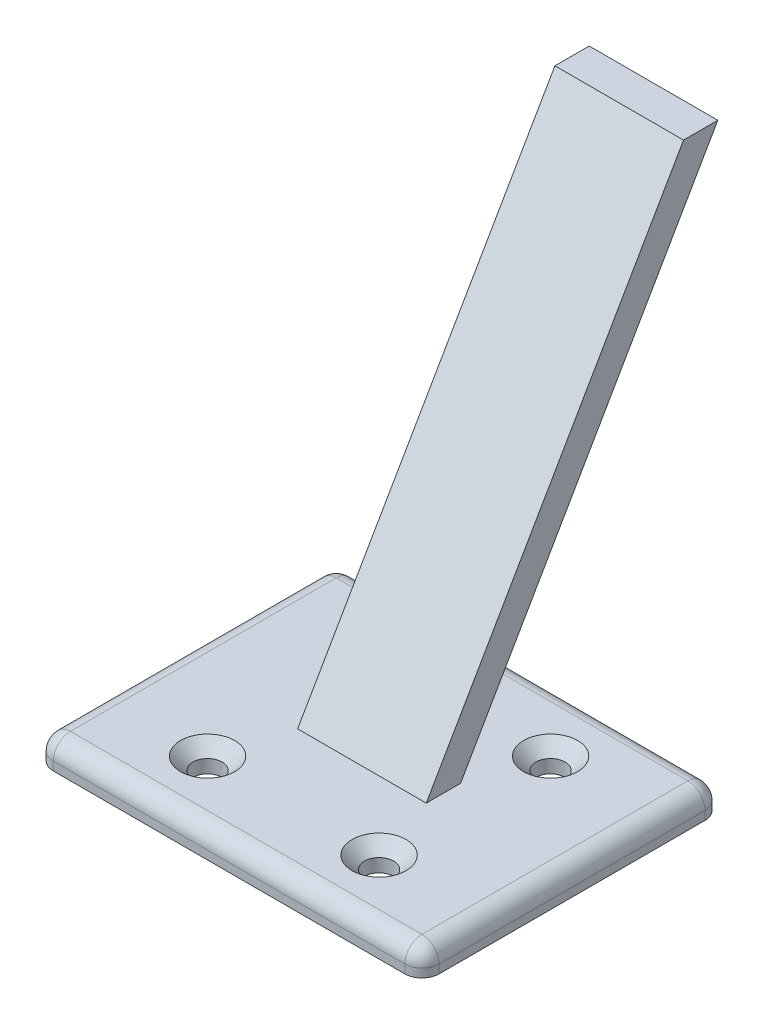
ISO-10303-21;
HEADER;
FILE_DESCRIPTION(('STEP AP214'),'2;1');
FILE_NAME('part.step','',(''),(''),'','','');
FILE_SCHEMA(('AUTOMOTIVE_DESIGN { 1 0 10303 214 1 1 1 1 }'));
ENDSEC;
DATA;
#1=APPLICATION_CONTEXT('core data for automotive mechanical design processes');
#2=APPLICATION_PROTOCOL_DEFINITION('international standard','automotive_design',2000,#1);
#3=PRODUCT_CONTEXT('',#1,'mechanical');
#4=PRODUCT('Part','Part','',(#3));
#5=PRODUCT_RELATED_PRODUCT_CATEGORY('part','',(#4));
#6=PRODUCT_DEFINITION_FORMATION('','',#4);
#7=PRODUCT_DEFINITION_CONTEXT('part definition',#1,'design');
#8=PRODUCT_DEFINITION('design','',#6,#7);
#9=PRODUCT_DEFINITION_SHAPE('','',#8);
#10=(LENGTH_UNIT() NAMED_UNIT(*) SI_UNIT(.MILLI.,.METRE.));
#11=(NAMED_UNIT(*) PLANE_ANGLE_UNIT() SI_UNIT($,.RADIAN.));
#12=(NAMED_UNIT(*) SI_UNIT($,.STERADIAN.) SOLID_ANGLE_UNIT());
#13=UNCERTAINTY_MEASURE_WITH_UNIT(LENGTH_MEASURE(1.E-05),#10,'distance_accuracy_value','');
#14=(GEOMETRIC_REPRESENTATION_CONTEXT(3) GLOBAL_UNCERTAINTY_ASSIGNED_CONTEXT((#13)) GLOBAL_UNIT_ASSIGNED_CONTEXT((#10,
#11,#12)) REPRESENTATION_CONTEXT('',''));
#15=CARTESIAN_POINT('',(0.,0.,0.));
#16=DIRECTION('',(0.,0.,1.));
#17=DIRECTION('',(1.,0.,0.));
#18=AXIS2_PLACEMENT_3D('',#15,#16,#17);
#19=CARTESIAN_POINT('',(0.,3.,0.));
#20=DIRECTION('',(0.,-1.,0.));
#21=DIRECTION('',(0.,0.,-1.));
#22=AXIS2_PLACEMENT_3D('',#19,#20,#21);
#23=PLANE('',#22);
#24=DIRECTION('',(-1.,0.,0.));
#25=VECTOR('',#24,1.);
#26=CARTESIAN_POINT('',(0.,3.,-15.5));
#27=LINE('',#26,#25);
#28=CARTESIAN_POINT('',(20.5,3.,-15.5));
#29=VERTEX_POINT('',#28);
#30=CARTESIAN_POINT('',(-20.5,3.,-15.5));
#31=VERTEX_POINT('',#30);
#32=EDGE_CURVE('E44',#29,#31,#27,.T.);
#33=ORIENTED_EDGE('',*,*,#32,.T.);
#34=DIRECTION('',(0.,0.,1.));
#35=VECTOR('',#34,1.);
#36=CARTESIAN_POINT('',(-20.5,3.,0.));
#37=LINE('',#36,#35);
#38=CARTESIAN_POINT('',(-20.5,3.,15.5));
#39=VERTEX_POINT('',#38);
#40=EDGE_CURVE('E11',#31,#39,#37,.T.);
#41=ORIENTED_EDGE('',*,*,#40,.T.);
#42=DIRECTION('',(1.,0.,0.));
#43=VECTOR('',#42,1.);
#44=CARTESIAN_POINT('',(0.,3.,15.5));
#45=LINE('',#44,#43);
#46=CARTESIAN_POINT('',(20.5,3.,15.5));
#47=VERTEX_POINT('',#46);
#48=EDGE_CURVE('E247',#39,#47,#45,.T.);
#49=ORIENTED_EDGE('',*,*,#48,.T.);
#50=DIRECTION('',(0.,0.,-1.));
#51=VECTOR('',#50,1.);
#52=CARTESIAN_POINT('',(20.5,3.,0.));
#53=LINE('',#52,#51);
#54=EDGE_CURVE('E55',#47,#29,#53,.T.);
#55=ORIENTED_EDGE('',*,*,#54,.T.);
#56=EDGE_LOOP('',(#33,#41,#49,#55));
#57=FACE_BOUND('',#56,.T.);
#58=CARTESIAN_POINT('',(9.99999999999998,3.,-10.));
#59=DIRECTION('',(0.,1.,0.));
#60=DIRECTION('',(0.,0.,1.));
#61=AXIS2_PLACEMENT_3D('',#58,#59,#60);
#62=CIRCLE('',#61,3.15);
#63=CARTESIAN_POINT('',(9.99999999999998,3.,-6.85000000000002));
#64=VERTEX_POINT('',#63);
#65=EDGE_CURVE('E161',#64,#64,#62,.T.);
#66=ORIENTED_EDGE('',*,*,#65,.F.);
#67=EDGE_LOOP('',(#66));
#68=FACE_BOUND('',#67,.T.);
#69=CARTESIAN_POINT('',(-10.,3.,-10.));
#70=DIRECTION('',(0.,1.,0.));
#71=DIRECTION('',(0.,0.,1.));
#72=AXIS2_PLACEMENT_3D('',#69,#70,#71);
#73=CIRCLE('',#72,3.15);
#74=CARTESIAN_POINT('',(-10.,3.,-6.85));
#75=VERTEX_POINT('',#74);
#76=EDGE_CURVE('E175',#75,#75,#73,.T.);
#77=ORIENTED_EDGE('',*,*,#76,.F.);
#78=EDGE_LOOP('',(#77));
#79=FACE_BOUND('',#78,.T.);
#80=CARTESIAN_POINT('',(-9.99999999999999,3.,10.));
#81=DIRECTION('',(0.,1.,0.));
#82=DIRECTION('',(0.,0.,1.));
#83=AXIS2_PLACEMENT_3D('',#80,#81,#82);
#84=CIRCLE('',#83,3.15);
#85=CARTESIAN_POINT('',(-9.99999999999999,3.,13.15));
#86=VERTEX_POINT('',#85);
#87=EDGE_CURVE('E184',#86,#86,#84,.T.);
#88=ORIENTED_EDGE('',*,*,#87,.F.);
#89=EDGE_LOOP('',(#88));
#90=FACE_BOUND('',#89,.T.);
#91=CARTESIAN_POINT('',(10.,3.,10.));
#92=DIRECTION('',(0.,1.,0.));
#93=DIRECTION('',(0.,0.,1.));
#94=AXIS2_PLACEMENT_3D('',#91,#92,#93);
#95=CIRCLE('',#94,3.15);
#96=CARTESIAN_POINT('',(10.,3.,13.15));
#97=VERTEX_POINT('',#96);
#98=EDGE_CURVE('E193',#97,#97,#95,.T.);
#99=ORIENTED_EDGE('',*,*,#98,.F.);
#100=EDGE_LOOP('',(#99));
#101=FACE_BOUND('',#100,.T.);
#102=DIRECTION('',(0.,0.,-1.));
#103=VECTOR('',#102,1.);
#104=CARTESIAN_POINT('',(7.5,3.,2.));
#105=LINE('',#104,#103);
#106=CARTESIAN_POINT('',(7.5,3.,2.));
#107=VERTEX_POINT('',#106);
#108=CARTESIAN_POINT('',(7.5,3.,-2.));
#109=VERTEX_POINT('',#108);
#110=EDGE_CURVE('E160',#107,#109,#105,.T.);
#111=ORIENTED_EDGE('',*,*,#110,.F.);
#112=DIRECTION('',(1.,0.,0.));
#113=VECTOR('',#112,1.);
#114=CARTESIAN_POINT('',(-7.5,3.,2.));
#115=LINE('',#114,#113);
#116=CARTESIAN_POINT('',(-7.5,3.,1.99999999999999));
#117=VERTEX_POINT('',#116);
#118=EDGE_CURVE('E157',#117,#107,#115,.T.);
#119=ORIENTED_EDGE('',*,*,#118,.F.);
#120=DIRECTION('',(0.,0.,1.));
#121=VECTOR('',#120,1.);
#122=CARTESIAN_POINT('',(-7.5,3.,2.));
#123=LINE('',#122,#121);
#124=CARTESIAN_POINT('',(-7.5,3.,-2.));
#125=VERTEX_POINT('',#124);
#126=EDGE_CURVE('E290',#125,#117,#123,.T.);
#127=ORIENTED_EDGE('',*,*,#126,.F.);
#128=DIRECTION('',(-1.,0.,0.));
#129=VECTOR('',#128,1.);
#130=CARTESIAN_POINT('',(-7.5,3.,-2.));
#131=LINE('',#130,#129);
#132=EDGE_CURVE('E288',#109,#125,#131,.T.);
#133=ORIENTED_EDGE('',*,*,#132,.F.);
#134=EDGE_LOOP('',(#111,#119,#127,#133));
#135=FACE_BOUND('',#134,.T.);
#136=ADVANCED_FACE('F35',(#57,#68,#79,#90,#101,#135),#23,.F.);
#137=CARTESIAN_POINT('',(-22.5,3.,-17.5));
#138=DIRECTION('',(1.,0.,0.));
#139=DIRECTION('',(0.,0.,-1.));
#140=AXIS2_PLACEMENT_3D('',#137,#138,#139);
#141=PLANE('',#140);
#142=DIRECTION('',(0.,0.,1.));
#143=VECTOR('',#142,1.);
#144=CARTESIAN_POINT('',(-22.5,1.,-17.5));
#145=LINE('',#144,#143);
#146=CARTESIAN_POINT('',(-22.5,1.,15.5));
#147=VERTEX_POINT('',#146);
#148=CARTESIAN_POINT('',(-22.5,1.,-15.5));
#149=VERTEX_POINT('',#148);
#150=EDGE_CURVE('E214',#147,#149,#145,.F.);
#151=ORIENTED_EDGE('',*,*,#150,.T.);
#152=DIRECTION('',(0.,-1.,0.));
#153=VECTOR('',#152,1.);
#154=CARTESIAN_POINT('',(-22.5,3.,-15.5));
#155=LINE('',#154,#153);
#156=CARTESIAN_POINT('',(-22.5,0.,-15.5));
#157=VERTEX_POINT('',#156);
#158=EDGE_CURVE('E218',#149,#157,#155,.T.);
#159=ORIENTED_EDGE('',*,*,#158,.T.);
#160=DIRECTION('',(0.,0.,1.));
#161=VECTOR('',#160,1.);
#162=CARTESIAN_POINT('',(-22.5,0.,-17.5));
#163=LINE('',#162,#161);
#164=CARTESIAN_POINT('',(-22.5,0.,15.5));
#165=VERTEX_POINT('',#164);
#166=EDGE_CURVE('E202',#157,#165,#163,.T.);
#167=ORIENTED_EDGE('',*,*,#166,.T.);
#168=DIRECTION('',(0.,-1.,0.));
#169=VECTOR('',#168,1.);
#170=CARTESIAN_POINT('',(-22.5,3.,15.5));
#171=LINE('',#170,#169);
#172=EDGE_CURVE('E216',#165,#147,#171,.F.);
#173=ORIENTED_EDGE('',*,*,#172,.T.);
#174=EDGE_LOOP('',(#151,#159,#167,#173));
#175=FACE_BOUND('',#174,.T.);
#176=ADVANCED_FACE('F308',(#175),#141,.F.);
#177=CARTESIAN_POINT('',(22.5,3.,17.5));
#178=DIRECTION('',(0.,0.,-1.));
#179=DIRECTION('',(-1.,0.,0.));
#180=AXIS2_PLACEMENT_3D('',#177,#178,#179);
#181=PLANE('',#180);
#182=DIRECTION('',(1.,0.,0.));
#183=VECTOR('',#182,1.);
#184=CARTESIAN_POINT('',(22.5,1.,17.5));
#185=LINE('',#184,#183);
#186=CARTESIAN_POINT('',(20.5,1.,17.5));
#187=VERTEX_POINT('',#186);
#188=CARTESIAN_POINT('',(-20.5,1.,17.5));
#189=VERTEX_POINT('',#188);
#190=EDGE_CURVE('E241',#187,#189,#185,.F.);
#191=ORIENTED_EDGE('',*,*,#190,.T.);
#192=DIRECTION('',(0.,-1.,0.));
#193=VECTOR('',#192,1.);
#194=CARTESIAN_POINT('',(-20.5,3.,17.5));
#195=LINE('',#194,#193);
#196=CARTESIAN_POINT('',(-20.5,0.,17.5));
#197=VERTEX_POINT('',#196);
#198=EDGE_CURVE('E245',#189,#197,#195,.T.);
#199=ORIENTED_EDGE('',*,*,#198,.T.);
#200=DIRECTION('',(1.,0.,0.));
#201=VECTOR('',#200,1.);
#202=CARTESIAN_POINT('',(22.5,0.,17.5));
#203=LINE('',#202,#201);
#204=CARTESIAN_POINT('',(20.5,0.,17.5));
#205=VERTEX_POINT('',#204);
#206=EDGE_CURVE('E205',#197,#205,#203,.T.);
#207=ORIENTED_EDGE('',*,*,#206,.T.);
#208=DIRECTION('',(0.,-1.,0.));
#209=VECTOR('',#208,1.);
#210=CARTESIAN_POINT('',(20.5,3.,17.5));
#211=LINE('',#210,#209);
#212=EDGE_CURVE('E243',#205,#187,#211,.F.);
#213=ORIENTED_EDGE('',*,*,#212,.T.);
#214=EDGE_LOOP('',(#191,#199,#207,#213));
#215=FACE_BOUND('',#214,.T.);
#216=ADVANCED_FACE('F313',(#215),#181,.F.);
#217=CARTESIAN_POINT('',(22.5,3.,-17.5));
#218=DIRECTION('',(-1.,0.,0.));
#219=DIRECTION('',(0.,0.,1.));
#220=AXIS2_PLACEMENT_3D('',#217,#218,#219);
#221=PLANE('',#220);
#222=DIRECTION('',(0.,0.,-1.));
#223=VECTOR('',#222,1.);
#224=CARTESIAN_POINT('',(22.5,0.,-17.5));
#225=LINE('',#224,#223);
#226=CARTESIAN_POINT('',(22.5,0.,15.5));
#227=VERTEX_POINT('',#226);
#228=CARTESIAN_POINT('',(22.5,0.,-15.5));
#229=VERTEX_POINT('',#228);
#230=EDGE_CURVE('E208',#227,#229,#225,.T.);
#231=ORIENTED_EDGE('',*,*,#230,.T.);
#232=DIRECTION('',(0.,-1.,0.));
#233=VECTOR('',#232,1.);
#234=CARTESIAN_POINT('',(22.5,3.,-15.5));
#235=LINE('',#234,#233);
#236=CARTESIAN_POINT('',(22.5,1.,-15.5));
#237=VERTEX_POINT('',#236);
#238=EDGE_CURVE('E239',#229,#237,#235,.F.);
#239=ORIENTED_EDGE('',*,*,#238,.T.);
#240=DIRECTION('',(0.,0.,-1.));
#241=VECTOR('',#240,1.);
#242=CARTESIAN_POINT('',(22.5,1.,-17.5));
#243=LINE('',#242,#241);
#244=CARTESIAN_POINT('',(22.5,1.,15.5));
#245=VERTEX_POINT('',#244);
#246=EDGE_CURVE('E235',#237,#245,#243,.F.);
#247=ORIENTED_EDGE('',*,*,#246,.T.);
#248=DIRECTION('',(0.,-1.,0.));
#249=VECTOR('',#248,1.);
#250=CARTESIAN_POINT('',(22.5,3.,15.5));
#251=LINE('',#250,#249);
#252=EDGE_CURVE('E237',#245,#227,#251,.T.);
#253=ORIENTED_EDGE('',*,*,#252,.T.);
#254=EDGE_LOOP('',(#231,#239,#247,#253));
#255=FACE_BOUND('',#254,.T.);
#256=ADVANCED_FACE('F328',(#255),#221,.F.);
#257=CARTESIAN_POINT('',(22.5,3.,-17.5));
#258=DIRECTION('',(0.,0.,1.));
#259=DIRECTION('',(1.,0.,0.));
#260=AXIS2_PLACEMENT_3D('',#257,#258,#259);
#261=PLANE('',#260);
#262=DIRECTION('',(-1.,0.,0.));
#263=VECTOR('',#262,1.);
#264=CARTESIAN_POINT('',(22.5,0.,-17.5));
#265=LINE('',#264,#263);
#266=CARTESIAN_POINT('',(20.5,0.,-17.5));
#267=VERTEX_POINT('',#266);
#268=CARTESIAN_POINT('',(-20.5,0.,-17.5));
#269=VERTEX_POINT('',#268);
#270=EDGE_CURVE('E211',#267,#269,#265,.T.);
#271=ORIENTED_EDGE('',*,*,#270,.T.);
#272=DIRECTION('',(0.,-1.,0.));
#273=VECTOR('',#272,1.);
#274=CARTESIAN_POINT('',(-20.5,3.,-17.5));
#275=LINE('',#274,#273);
#276=CARTESIAN_POINT('',(-20.5,1.,-17.5));
#277=VERTEX_POINT('',#276);
#278=EDGE_CURVE('E233',#269,#277,#275,.F.);
#279=ORIENTED_EDGE('',*,*,#278,.T.);
#280=DIRECTION('',(-1.,0.,0.));
#281=VECTOR('',#280,1.);
#282=CARTESIAN_POINT('',(22.5,1.,-17.5));
#283=LINE('',#282,#281);
#284=CARTESIAN_POINT('',(20.5,1.,-17.5));
#285=VERTEX_POINT('',#284);
#286=EDGE_CURVE('E229',#277,#285,#283,.F.);
#287=ORIENTED_EDGE('',*,*,#286,.T.);
#288=DIRECTION('',(0.,-1.,0.));
#289=VECTOR('',#288,1.);
#290=CARTESIAN_POINT('',(20.5,3.,-17.5));
#291=LINE('',#290,#289);
#292=EDGE_CURVE('E231',#285,#267,#291,.T.);
#293=ORIENTED_EDGE('',*,*,#292,.T.);
#294=EDGE_LOOP('',(#271,#279,#287,#293));
#295=FACE_BOUND('',#294,.T.);
#296=ADVANCED_FACE('F324',(#295),#261,.F.);
#297=CARTESIAN_POINT('',(0.,0.,0.));
#298=DIRECTION('',(0.,-1.,0.));
#299=DIRECTION('',(0.,0.,-1.));
#300=AXIS2_PLACEMENT_3D('',#297,#298,#299);
#301=PLANE('',#300);
#302=CARTESIAN_POINT('',(9.99999999999998,0.,-10.));
#303=DIRECTION('',(0.,-1.,0.));
#304=DIRECTION('',(0.,0.,-1.));
#305=AXIS2_PLACEMENT_3D('',#302,#303,#304);
#306=CIRCLE('',#305,1.69999999999999);
#307=CARTESIAN_POINT('',(9.99999999999998,0.,-11.7));
#308=VERTEX_POINT('',#307);
#309=EDGE_CURVE('E172',#308,#308,#306,.T.);
#310=ORIENTED_EDGE('',*,*,#309,.F.);
#311=EDGE_LOOP('',(#310));
#312=FACE_BOUND('',#311,.T.);
#313=CARTESIAN_POINT('',(-10.,0.,-10.));
#314=DIRECTION('',(0.,-1.,0.));
#315=DIRECTION('',(0.,0.,-1.));
#316=AXIS2_PLACEMENT_3D('',#313,#314,#315);
#317=CIRCLE('',#316,1.69999999999999);
#318=CARTESIAN_POINT('',(-10.,0.,-11.7));
#319=VERTEX_POINT('',#318);
#320=EDGE_CURVE('E181',#319,#319,#317,.T.);
#321=ORIENTED_EDGE('',*,*,#320,.F.);
#322=EDGE_LOOP('',(#321));
#323=FACE_BOUND('',#322,.T.);
#324=CARTESIAN_POINT('',(-9.99999999999999,0.,10.));
#325=DIRECTION('',(0.,-1.,0.));
#326=DIRECTION('',(0.,0.,-1.));
#327=AXIS2_PLACEMENT_3D('',#324,#325,#326);
#328=CIRCLE('',#327,1.69999999999999);
#329=CARTESIAN_POINT('',(-9.99999999999999,0.,8.30000000000001));
#330=VERTEX_POINT('',#329);
#331=EDGE_CURVE('E190',#330,#330,#328,.T.);
#332=ORIENTED_EDGE('',*,*,#331,.F.);
#333=EDGE_LOOP('',(#332));
#334=FACE_BOUND('',#333,.T.);
#335=CARTESIAN_POINT('',(10.,0.,10.));
#336=DIRECTION('',(0.,-1.,0.));
#337=DIRECTION('',(0.,0.,-1.));
#338=AXIS2_PLACEMENT_3D('',#335,#336,#337);
#339=CIRCLE('',#338,1.69999999999999);
#340=CARTESIAN_POINT('',(10.,0.,8.30000000000002));
#341=VERTEX_POINT('',#340);
#342=EDGE_CURVE('E199',#341,#341,#339,.T.);
#343=ORIENTED_EDGE('',*,*,#342,.F.);
#344=EDGE_LOOP('',(#343));
#345=FACE_BOUND('',#344,.T.);
#346=ORIENTED_EDGE('',*,*,#166,.F.);
#347=CARTESIAN_POINT('',(-20.5,0.,-15.5));
#348=DIRECTION('',(0.,-1.,0.));
#349=DIRECTION('',(0.,0.,-1.));
#350=AXIS2_PLACEMENT_3D('',#347,#348,#349);
#351=CIRCLE('',#350,2.);
#352=EDGE_CURVE('E227',#157,#269,#351,.T.);
#353=ORIENTED_EDGE('',*,*,#352,.T.);
#354=ORIENTED_EDGE('',*,*,#270,.F.);
#355=CARTESIAN_POINT('',(20.5,0.,-15.5));
#356=DIRECTION('',(0.,-1.,0.));
#357=DIRECTION('',(0.,0.,-1.));
#358=AXIS2_PLACEMENT_3D('',#355,#356,#357);
#359=CIRCLE('',#358,2.);
#360=EDGE_CURVE('E225',#267,#229,#359,.T.);
#361=ORIENTED_EDGE('',*,*,#360,.T.);
#362=ORIENTED_EDGE('',*,*,#230,.F.);
#363=CARTESIAN_POINT('',(20.5,0.,15.5));
#364=DIRECTION('',(0.,-1.,0.));
#365=DIRECTION('',(0.,0.,-1.));
#366=AXIS2_PLACEMENT_3D('',#363,#364,#365);
#367=CIRCLE('',#366,2.);
#368=EDGE_CURVE('E221',#227,#205,#367,.T.);
#369=ORIENTED_EDGE('',*,*,#368,.T.);
#370=ORIENTED_EDGE('',*,*,#206,.F.);
#371=CARTESIAN_POINT('',(-20.5,0.,15.5));
#372=DIRECTION('',(0.,-1.,0.));
#373=DIRECTION('',(0.,0.,-1.));
#374=AXIS2_PLACEMENT_3D('',#371,#372,#373);
#375=CIRCLE('',#374,2.);
#376=EDGE_CURVE('E223',#197,#165,#375,.T.);
#377=ORIENTED_EDGE('',*,*,#376,.T.);
#378=EDGE_LOOP('',(#346,#353,#354,#361,#362,#369,#370,#377));
#379=FACE_BOUND('',#378,.T.);
#380=ADVANCED_FACE('F321',(#312,#323,#334,#345,#379),#301,.T.);
#381=CARTESIAN_POINT('',(10.,3.,10.));
#382=DIRECTION('',(0.,1.,0.));
#383=DIRECTION('',(0.,0.,1.));
#384=AXIS2_PLACEMENT_3D('',#381,#382,#383);
#385=CYLINDRICAL_SURFACE('',#384,1.69999999999999);
#386=CARTESIAN_POINT('',(10.,1.54999999999999,10.));
#387=DIRECTION('',(0.,1.,0.));
#388=DIRECTION('',(0.,0.,1.));
#389=AXIS2_PLACEMENT_3D('',#386,#387,#388);
#390=CIRCLE('',#389,1.69999999999999);
#391=CARTESIAN_POINT('',(10.,1.54999999999999,11.7));
#392=VERTEX_POINT('',#391);
#393=EDGE_CURVE('E196',#392,#392,#390,.T.);
#394=ORIENTED_EDGE('',*,*,#393,.T.);
#395=EDGE_LOOP('',(#394));
#396=FACE_BOUND('',#395,.T.);
#397=ORIENTED_EDGE('',*,*,#342,.T.);
#398=EDGE_LOOP('',(#397));
#399=FACE_BOUND('',#398,.T.);
#400=ADVANCED_FACE('F319',(#396,#399),#385,.F.);
#401=CARTESIAN_POINT('',(10.,3.,10.));
#402=DIRECTION('',(0.,1.,0.));
#403=DIRECTION('',(0.,0.,1.));
#404=AXIS2_PLACEMENT_3D('',#401,#402,#403);
#405=CONICAL_SURFACE('',#404,3.15,0.78539816339745);
#406=ORIENTED_EDGE('',*,*,#393,.F.);
#407=EDGE_LOOP('',(#406));
#408=FACE_BOUND('',#407,.T.);
#409=ORIENTED_EDGE('',*,*,#98,.T.);
#410=EDGE_LOOP('',(#409));
#411=FACE_BOUND('',#410,.T.);
#412=ADVANCED_FACE('F445',(#408,#411),#405,.F.);
#413=CARTESIAN_POINT('',(-9.99999999999999,3.,10.));
#414=DIRECTION('',(0.,1.,0.));
#415=DIRECTION('',(0.,0.,1.));
#416=AXIS2_PLACEMENT_3D('',#413,#414,#415);
#417=CYLINDRICAL_SURFACE('',#416,1.69999999999999);
#418=CARTESIAN_POINT('',(-9.99999999999999,1.54999999999999,10.));
#419=DIRECTION('',(0.,1.,0.));
#420=DIRECTION('',(0.,0.,1.));
#421=AXIS2_PLACEMENT_3D('',#418,#419,#420);
#422=CIRCLE('',#421,1.69999999999999);
#423=CARTESIAN_POINT('',(-9.99999999999999,1.54999999999999,11.7));
#424=VERTEX_POINT('',#423);
#425=EDGE_CURVE('E187',#424,#424,#422,.T.);
#426=ORIENTED_EDGE('',*,*,#425,.T.);
#427=EDGE_LOOP('',(#426));
#428=FACE_BOUND('',#427,.T.);
#429=ORIENTED_EDGE('',*,*,#331,.T.);
#430=EDGE_LOOP('',(#429));
#431=FACE_BOUND('',#430,.T.);
#432=ADVANCED_FACE('F442',(#428,#431),#417,.F.);
#433=CARTESIAN_POINT('',(-9.99999999999999,3.,10.));
#434=DIRECTION('',(0.,1.,0.));
#435=DIRECTION('',(0.,0.,1.));
#436=AXIS2_PLACEMENT_3D('',#433,#434,#435);
#437=CONICAL_SURFACE('',#436,3.15,0.78539816339745);
#438=ORIENTED_EDGE('',*,*,#425,.F.);
#439=EDGE_LOOP('',(#438));
#440=FACE_BOUND('',#439,.T.);
#441=ORIENTED_EDGE('',*,*,#87,.T.);
#442=EDGE_LOOP('',(#441));
#443=FACE_BOUND('',#442,.T.);
#444=ADVANCED_FACE('F438',(#440,#443),#437,.F.);
#445=CARTESIAN_POINT('',(-10.,3.,-10.));
#446=DIRECTION('',(0.,1.,0.));
#447=DIRECTION('',(0.,0.,1.));
#448=AXIS2_PLACEMENT_3D('',#445,#446,#447);
#449=CYLINDRICAL_SURFACE('',#448,1.69999999999999);
#450=CARTESIAN_POINT('',(-10.,1.54999999999999,-10.));
#451=DIRECTION('',(0.,1.,0.));
#452=DIRECTION('',(0.,0.,1.));
#453=AXIS2_PLACEMENT_3D('',#450,#451,#452);
#454=CIRCLE('',#453,1.69999999999999);
#455=CARTESIAN_POINT('',(-10.,1.54999999999999,-8.30000000000001));
#456=VERTEX_POINT('',#455);
#457=EDGE_CURVE('E178',#456,#456,#454,.T.);
#458=ORIENTED_EDGE('',*,*,#457,.T.);
#459=EDGE_LOOP('',(#458));
#460=FACE_BOUND('',#459,.T.);
#461=ORIENTED_EDGE('',*,*,#320,.T.);
#462=EDGE_LOOP('',(#461));
#463=FACE_BOUND('',#462,.T.);
#464=ADVANCED_FACE('F434',(#460,#463),#449,.F.);
#465=CARTESIAN_POINT('',(-10.,3.,-10.));
#466=DIRECTION('',(0.,1.,0.));
#467=DIRECTION('',(0.,0.,1.));
#468=AXIS2_PLACEMENT_3D('',#465,#466,#467);
#469=CONICAL_SURFACE('',#468,3.15,0.78539816339745);
#470=ORIENTED_EDGE('',*,*,#457,.F.);
#471=EDGE_LOOP('',(#470));
#472=FACE_BOUND('',#471,.T.);
#473=ORIENTED_EDGE('',*,*,#76,.T.);
#474=EDGE_LOOP('',(#473));
#475=FACE_BOUND('',#474,.T.);
#476=ADVANCED_FACE('F430',(#472,#475),#469,.F.);
#477=CARTESIAN_POINT('',(9.99999999999998,3.,-10.));
#478=DIRECTION('',(0.,1.,0.));
#479=DIRECTION('',(0.,0.,1.));
#480=AXIS2_PLACEMENT_3D('',#477,#478,#479);
#481=CYLINDRICAL_SURFACE('',#480,1.69999999999999);
#482=CARTESIAN_POINT('',(9.99999999999998,1.54999999999999,-10.));
#483=DIRECTION('',(0.,1.,0.));
#484=DIRECTION('',(0.,0.,1.));
#485=AXIS2_PLACEMENT_3D('',#482,#483,#484);
#486=CIRCLE('',#485,1.69999999999999);
#487=CARTESIAN_POINT('',(9.99999999999998,1.54999999999999,-8.30000000000003));
#488=VERTEX_POINT('',#487);
#489=EDGE_CURVE('E164',#488,#488,#486,.T.);
#490=ORIENTED_EDGE('',*,*,#489,.T.);
#491=EDGE_LOOP('',(#490));
#492=FACE_BOUND('',#491,.T.);
#493=ORIENTED_EDGE('',*,*,#309,.T.);
#494=EDGE_LOOP('',(#493));
#495=FACE_BOUND('',#494,.T.);
#496=ADVANCED_FACE('F426',(#492,#495),#481,.F.);
#497=CARTESIAN_POINT('',(9.99999999999998,3.,-10.));
#498=DIRECTION('',(0.,1.,0.));
#499=DIRECTION('',(0.,0.,1.));
#500=AXIS2_PLACEMENT_3D('',#497,#498,#499);
#501=CONICAL_SURFACE('',#500,3.15,0.78539816339745);
#502=ORIENTED_EDGE('',*,*,#489,.F.);
#503=EDGE_LOOP('',(#502));
#504=FACE_BOUND('',#503,.T.);
#505=ORIENTED_EDGE('',*,*,#65,.T.);
#506=EDGE_LOOP('',(#505));
#507=FACE_BOUND('',#506,.T.);
#508=ADVANCED_FACE('F423',(#504,#507),#501,.F.);
#509=CARTESIAN_POINT('',(7.5,54.9615242270662,-28.0000000000002));
#510=DIRECTION('',(-1.,0.,0.));
#511=DIRECTION('',(0.,0.,1.));
#512=AXIS2_PLACEMENT_3D('',#509,#510,#511);
#513=PLANE('',#512);
#514=ORIENTED_EDGE('',*,*,#110,.T.);
#515=DIRECTION('',(0.,-0.866025403784436,0.500000000000004));
#516=VECTOR('',#515,1.);
#517=CARTESIAN_POINT('',(7.5,54.9615242270662,-32.0000000000002));
#518=LINE('',#517,#516);
#519=CARTESIAN_POINT('',(7.5,54.9615242270662,-32.0000000000002));
#520=VERTEX_POINT('',#519);
#521=EDGE_CURVE('E141',#520,#109,#518,.T.);
#522=ORIENTED_EDGE('',*,*,#521,.F.);
#523=DIRECTION('',(0.,0.,-1.));
#524=VECTOR('',#523,1.);
#525=CARTESIAN_POINT('',(7.5,54.9615242270662,-28.0000000000002));
#526=LINE('',#525,#524);
#527=CARTESIAN_POINT('',(7.5,54.9615242270662,-28.0000000000002));
#528=VERTEX_POINT('',#527);
#529=EDGE_CURVE('E148',#528,#520,#526,.T.);
#530=ORIENTED_EDGE('',*,*,#529,.F.);
#531=DIRECTION('',(0.,-0.866025403784436,0.500000000000004));
#532=VECTOR('',#531,1.);
#533=CARTESIAN_POINT('',(7.5,54.9615242270662,-28.0000000000002));
#534=LINE('',#533,#532);
#535=EDGE_CURVE('E299',#528,#107,#534,.T.);
#536=ORIENTED_EDGE('',*,*,#535,.T.);
#537=EDGE_LOOP('',(#514,#522,#530,#536));
#538=FACE_BOUND('',#537,.T.);
#539=ADVANCED_FACE('F159',(#538),#513,.F.);
#540=CARTESIAN_POINT('',(-7.5,54.9615242270662,-32.0000000000002));
#541=DIRECTION('',(0.,0.500000000000004,0.866025403784436));
#542=DIRECTION('',(0.,-0.866025403784436,0.500000000000004));
#543=AXIS2_PLACEMENT_3D('',#540,#541,#542);
#544=PLANE('',#543);
#545=ORIENTED_EDGE('',*,*,#132,.T.);
#546=DIRECTION('',(0.,-0.866025403784436,0.500000000000004));
#547=VECTOR('',#546,1.);
#548=CARTESIAN_POINT('',(-7.5,54.9615242270662,-32.0000000000002));
#549=LINE('',#548,#547);
#550=CARTESIAN_POINT('',(-7.5,54.9615242270662,-32.0000000000002));
#551=VERTEX_POINT('',#550);
#552=EDGE_CURVE('E144',#551,#125,#549,.T.);
#553=ORIENTED_EDGE('',*,*,#552,.F.);
#554=DIRECTION('',(-1.,0.,0.));
#555=VECTOR('',#554,1.);
#556=CARTESIAN_POINT('',(-7.5,54.9615242270662,-32.0000000000002));
#557=LINE('',#556,#555);
#558=EDGE_CURVE('E136',#520,#551,#557,.T.);
#559=ORIENTED_EDGE('',*,*,#558,.F.);
#560=ORIENTED_EDGE('',*,*,#521,.T.);
#561=EDGE_LOOP('',(#545,#553,#559,#560));
#562=FACE_BOUND('',#561,.T.);
#563=ADVANCED_FACE('F139',(#562),#544,.F.);
#564=CARTESIAN_POINT('',(-7.5,54.9615242270662,-28.0000000000002));
#565=DIRECTION('',(1.,0.,0.));
#566=DIRECTION('',(0.,0.,-1.));
#567=AXIS2_PLACEMENT_3D('',#564,#565,#566);
#568=PLANE('',#567);
#569=ORIENTED_EDGE('',*,*,#126,.T.);
#570=DIRECTION('',(0.,-0.866025403784436,0.500000000000004));
#571=VECTOR('',#570,1.);
#572=CARTESIAN_POINT('',(-7.5,54.9615242270662,-28.0000000000002));
#573=LINE('',#572,#571);
#574=CARTESIAN_POINT('',(-7.5,54.9615242270662,-28.0000000000002));
#575=VERTEX_POINT('',#574);
#576=EDGE_CURVE('E166',#575,#117,#573,.T.);
#577=ORIENTED_EDGE('',*,*,#576,.F.);
#578=DIRECTION('',(0.,0.,1.));
#579=VECTOR('',#578,1.);
#580=CARTESIAN_POINT('',(-7.5,54.9615242270662,-28.0000000000002));
#581=LINE('',#580,#579);
#582=EDGE_CURVE('E147',#551,#575,#581,.T.);
#583=ORIENTED_EDGE('',*,*,#582,.F.);
#584=ORIENTED_EDGE('',*,*,#552,.T.);
#585=EDGE_LOOP('',(#569,#577,#583,#584));
#586=FACE_BOUND('',#585,.T.);
#587=ADVANCED_FACE('F305',(#586),#568,.F.);
#588=CARTESIAN_POINT('',(-7.5,54.9615242270662,-28.0000000000002));
#589=DIRECTION('',(0.,-0.500000000000004,-0.866025403784436));
#590=DIRECTION('',(0.,0.866025403784436,-0.500000000000004));
#591=AXIS2_PLACEMENT_3D('',#588,#589,#590);
#592=PLANE('',#591);
#593=ORIENTED_EDGE('',*,*,#118,.T.);
#594=ORIENTED_EDGE('',*,*,#535,.F.);
#595=DIRECTION('',(1.,0.,0.));
#596=VECTOR('',#595,1.);
#597=CARTESIAN_POINT('',(-7.5,54.9615242270662,-28.0000000000002));
#598=LINE('',#597,#596);
#599=EDGE_CURVE('E153',#575,#528,#598,.T.);
#600=ORIENTED_EDGE('',*,*,#599,.F.);
#601=ORIENTED_EDGE('',*,*,#576,.T.);
#602=EDGE_LOOP('',(#593,#594,#600,#601));
#603=FACE_BOUND('',#602,.T.);
#604=ADVANCED_FACE('F303',(#603),#592,.F.);
#605=CARTESIAN_POINT('',(0.,54.9615242270662,-30.0000000000002));
#606=DIRECTION('',(0.,-1.,0.));
#607=DIRECTION('',(0.,0.,-1.));
#608=AXIS2_PLACEMENT_3D('',#605,#606,#607);
#609=PLANE('',#608);
#610=ORIENTED_EDGE('',*,*,#529,.T.);
#611=ORIENTED_EDGE('',*,*,#558,.T.);
#612=ORIENTED_EDGE('',*,*,#582,.T.);
#613=ORIENTED_EDGE('',*,*,#599,.T.);
#614=EDGE_LOOP('',(#610,#611,#612,#613));
#615=FACE_BOUND('',#614,.T.);
#616=ADVANCED_FACE('F151',(#615),#609,.F.);
#617=CARTESIAN_POINT('',(20.5,3.,15.5));
#618=DIRECTION('',(0.,-1.,0.));
#619=DIRECTION('',(0.,0.,-1.));
#620=AXIS2_PLACEMENT_3D('',#617,#618,#619);
#621=CYLINDRICAL_SURFACE('',#620,2.);
#622=CARTESIAN_POINT('',(20.5,1.,15.5));
#623=DIRECTION('',(0.,1.,0.));
#624=DIRECTION('',(0.,0.,1.));
#625=AXIS2_PLACEMENT_3D('',#622,#623,#624);
#626=CIRCLE('',#625,2.);
#627=EDGE_CURVE('E39',#187,#245,#626,.T.);
#628=ORIENTED_EDGE('',*,*,#627,.F.);
#629=ORIENTED_EDGE('',*,*,#212,.F.);
#630=ORIENTED_EDGE('',*,*,#368,.F.);
#631=ORIENTED_EDGE('',*,*,#252,.F.);
#632=EDGE_LOOP('',(#628,#629,#630,#631));
#633=FACE_BOUND('',#632,.T.);
#634=ADVANCED_FACE('F37',(#633),#621,.T.);
#635=CARTESIAN_POINT('',(20.5,1.,15.5));
#636=DIRECTION('',(0.,0.,1.));
#637=DIRECTION('',(1.,0.,0.));
#638=AXIS2_PLACEMENT_3D('',#635,#636,#637);
#639=SPHERICAL_SURFACE('',#638,2.);
#640=CARTESIAN_POINT('',(20.5,1.,15.5));
#641=DIRECTION('',(1.,0.,0.));
#642=DIRECTION('',(0.,0.,-1.));
#643=AXIS2_PLACEMENT_3D('',#640,#641,#642);
#644=CIRCLE('',#643,2.);
#645=EDGE_CURVE('E277',#187,#47,#644,.F.);
#646=ORIENTED_EDGE('',*,*,#645,.F.);
#647=ORIENTED_EDGE('',*,*,#627,.T.);
#648=CARTESIAN_POINT('',(20.5,1.,15.5));
#649=DIRECTION('',(0.,0.,1.));
#650=DIRECTION('',(0.,-1.,0.));
#651=AXIS2_PLACEMENT_3D('',#648,#649,#650);
#652=CIRCLE('',#651,2.);
#653=EDGE_CURVE('E279',#47,#245,#652,.F.);
#654=ORIENTED_EDGE('',*,*,#653,.F.);
#655=EDGE_LOOP('',(#646,#647,#654));
#656=FACE_BOUND('',#655,.T.);
#657=ADVANCED_FACE('F373',(#656),#639,.T.);
#658=CARTESIAN_POINT('',(20.5,3.,-15.5));
#659=DIRECTION('',(0.,-1.,0.));
#660=DIRECTION('',(0.,0.,-1.));
#661=AXIS2_PLACEMENT_3D('',#658,#659,#660);
#662=CYLINDRICAL_SURFACE('',#661,2.);
#663=ORIENTED_EDGE('',*,*,#360,.F.);
#664=ORIENTED_EDGE('',*,*,#292,.F.);
#665=CARTESIAN_POINT('',(20.5,1.,-15.5));
#666=DIRECTION('',(0.,1.,0.));
#667=DIRECTION('',(0.,0.,1.));
#668=AXIS2_PLACEMENT_3D('',#665,#666,#667);
#669=CIRCLE('',#668,2.);
#670=EDGE_CURVE('E274',#237,#285,#669,.T.);
#671=ORIENTED_EDGE('',*,*,#670,.F.);
#672=ORIENTED_EDGE('',*,*,#238,.F.);
#673=EDGE_LOOP('',(#663,#664,#671,#672));
#674=FACE_BOUND('',#673,.T.);
#675=ADVANCED_FACE('F371',(#674),#662,.T.);
#676=CARTESIAN_POINT('',(20.5,1.,0.));
#677=DIRECTION('',(0.,0.,-1.));
#678=DIRECTION('',(-1.,0.,0.));
#679=AXIS2_PLACEMENT_3D('',#676,#677,#678);
#680=CYLINDRICAL_SURFACE('',#679,2.);
#681=ORIENTED_EDGE('',*,*,#653,.T.);
#682=ORIENTED_EDGE('',*,*,#246,.F.);
#683=CARTESIAN_POINT('',(20.5,1.,-15.5));
#684=DIRECTION('',(0.,0.,-1.));
#685=DIRECTION('',(-1.,0.,0.));
#686=AXIS2_PLACEMENT_3D('',#683,#684,#685);
#687=CIRCLE('',#686,2.);
#688=EDGE_CURVE('E271',#29,#237,#687,.T.);
#689=ORIENTED_EDGE('',*,*,#688,.F.);
#690=ORIENTED_EDGE('',*,*,#54,.F.);
#691=EDGE_LOOP('',(#681,#682,#689,#690));
#692=FACE_BOUND('',#691,.T.);
#693=ADVANCED_FACE('F367',(#692),#680,.T.);
#694=CARTESIAN_POINT('',(0.,1.,15.5));
#695=DIRECTION('',(1.,0.,0.));
#696=DIRECTION('',(0.,0.,-1.));
#697=AXIS2_PLACEMENT_3D('',#694,#695,#696);
#698=CYLINDRICAL_SURFACE('',#697,2.);
#699=ORIENTED_EDGE('',*,*,#645,.T.);
#700=ORIENTED_EDGE('',*,*,#48,.F.);
#701=CARTESIAN_POINT('',(-20.5,1.,15.5));
#702=DIRECTION('',(-1.,0.,0.));
#703=DIRECTION('',(0.,-1.,0.));
#704=AXIS2_PLACEMENT_3D('',#701,#702,#703);
#705=CIRCLE('',#704,2.);
#706=EDGE_CURVE('E268',#189,#39,#705,.T.);
#707=ORIENTED_EDGE('',*,*,#706,.F.);
#708=ORIENTED_EDGE('',*,*,#190,.F.);
#709=EDGE_LOOP('',(#699,#700,#707,#708));
#710=FACE_BOUND('',#709,.T.);
#711=ADVANCED_FACE('F363',(#710),#698,.T.);
#712=CARTESIAN_POINT('',(-20.5,3.,15.5));
#713=DIRECTION('',(0.,-1.,0.));
#714=DIRECTION('',(0.,0.,-1.));
#715=AXIS2_PLACEMENT_3D('',#712,#713,#714);
#716=CYLINDRICAL_SURFACE('',#715,2.);
#717=ORIENTED_EDGE('',*,*,#376,.F.);
#718=ORIENTED_EDGE('',*,*,#198,.F.);
#719=CARTESIAN_POINT('',(-20.5,1.,15.5));
#720=DIRECTION('',(0.,1.,0.));
#721=DIRECTION('',(0.,0.,1.));
#722=AXIS2_PLACEMENT_3D('',#719,#720,#721);
#723=CIRCLE('',#722,2.);
#724=EDGE_CURVE('E265',#147,#189,#723,.T.);
#725=ORIENTED_EDGE('',*,*,#724,.F.);
#726=ORIENTED_EDGE('',*,*,#172,.F.);
#727=EDGE_LOOP('',(#717,#718,#725,#726));
#728=FACE_BOUND('',#727,.T.);
#729=ADVANCED_FACE('F359',(#728),#716,.T.);
#730=CARTESIAN_POINT('',(20.5,1.,-15.5));
#731=DIRECTION('',(0.,0.,1.));
#732=DIRECTION('',(1.,0.,0.));
#733=AXIS2_PLACEMENT_3D('',#730,#731,#732);
#734=SPHERICAL_SURFACE('',#733,2.);
#735=ORIENTED_EDGE('',*,*,#688,.T.);
#736=ORIENTED_EDGE('',*,*,#670,.T.);
#737=CARTESIAN_POINT('',(20.5,1.,-15.5));
#738=DIRECTION('',(1.,0.,0.));
#739=DIRECTION('',(0.,0.,-1.));
#740=AXIS2_PLACEMENT_3D('',#737,#738,#739);
#741=CIRCLE('',#740,2.);
#742=EDGE_CURVE('E262',#29,#285,#741,.F.);
#743=ORIENTED_EDGE('',*,*,#742,.F.);
#744=EDGE_LOOP('',(#735,#736,#743));
#745=FACE_BOUND('',#744,.T.);
#746=ADVANCED_FACE('F355',(#745),#734,.T.);
#747=CARTESIAN_POINT('',(-20.5,1.,15.5));
#748=DIRECTION('',(0.,0.,1.));
#749=DIRECTION('',(1.,0.,0.));
#750=AXIS2_PLACEMENT_3D('',#747,#748,#749);
#751=SPHERICAL_SURFACE('',#750,2.);
#752=ORIENTED_EDGE('',*,*,#724,.T.);
#753=ORIENTED_EDGE('',*,*,#706,.T.);
#754=CARTESIAN_POINT('',(-20.5,1.,15.5));
#755=DIRECTION('',(0.,0.,1.));
#756=DIRECTION('',(1.,0.,0.));
#757=AXIS2_PLACEMENT_3D('',#754,#755,#756);
#758=CIRCLE('',#757,2.);
#759=EDGE_CURVE('E260',#147,#39,#758,.F.);
#760=ORIENTED_EDGE('',*,*,#759,.F.);
#761=EDGE_LOOP('',(#752,#753,#760));
#762=FACE_BOUND('',#761,.T.);
#763=ADVANCED_FACE('F351',(#762),#751,.T.);
#764=CARTESIAN_POINT('',(0.,1.,-15.5));
#765=DIRECTION('',(-1.,0.,0.));
#766=DIRECTION('',(0.,0.,1.));
#767=AXIS2_PLACEMENT_3D('',#764,#765,#766);
#768=CYLINDRICAL_SURFACE('',#767,2.);
#769=ORIENTED_EDGE('',*,*,#742,.T.);
#770=ORIENTED_EDGE('',*,*,#286,.F.);
#771=CARTESIAN_POINT('',(-20.5,1.,-15.5));
#772=DIRECTION('',(-1.,0.,0.));
#773=DIRECTION('',(0.,0.,1.));
#774=AXIS2_PLACEMENT_3D('',#771,#772,#773);
#775=CIRCLE('',#774,2.);
#776=EDGE_CURVE('E257',#31,#277,#775,.T.);
#777=ORIENTED_EDGE('',*,*,#776,.F.);
#778=ORIENTED_EDGE('',*,*,#32,.F.);
#779=EDGE_LOOP('',(#769,#770,#777,#778));
#780=FACE_BOUND('',#779,.T.);
#781=ADVANCED_FACE('F347',(#780),#768,.T.);
#782=CARTESIAN_POINT('',(-20.5,1.,0.));
#783=DIRECTION('',(0.,0.,1.));
#784=DIRECTION('',(1.,0.,0.));
#785=AXIS2_PLACEMENT_3D('',#782,#783,#784);
#786=CYLINDRICAL_SURFACE('',#785,2.);
#787=ORIENTED_EDGE('',*,*,#759,.T.);
#788=ORIENTED_EDGE('',*,*,#40,.F.);
#789=CARTESIAN_POINT('',(-20.5,1.,-15.5));
#790=DIRECTION('',(0.,0.,-1.));
#791=DIRECTION('',(-1.,0.,0.));
#792=AXIS2_PLACEMENT_3D('',#789,#790,#791);
#793=CIRCLE('',#792,2.);
#794=EDGE_CURVE('E254',#149,#31,#793,.T.);
#795=ORIENTED_EDGE('',*,*,#794,.F.);
#796=ORIENTED_EDGE('',*,*,#150,.F.);
#797=EDGE_LOOP('',(#787,#788,#795,#796));
#798=FACE_BOUND('',#797,.T.);
#799=ADVANCED_FACE('F343',(#798),#786,.T.);
#800=CARTESIAN_POINT('',(-20.5,1.,-15.5));
#801=DIRECTION('',(0.,0.,1.));
#802=DIRECTION('',(1.,0.,0.));
#803=AXIS2_PLACEMENT_3D('',#800,#801,#802);
#804=SPHERICAL_SURFACE('',#803,2.);
#805=ORIENTED_EDGE('',*,*,#794,.T.);
#806=ORIENTED_EDGE('',*,*,#776,.T.);
#807=CARTESIAN_POINT('',(-20.5,1.,-15.5));
#808=DIRECTION('',(0.,1.,0.));
#809=DIRECTION('',(0.,0.,1.));
#810=AXIS2_PLACEMENT_3D('',#807,#808,#809);
#811=CIRCLE('',#810,2.);
#812=EDGE_CURVE('E251',#149,#277,#811,.F.);
#813=ORIENTED_EDGE('',*,*,#812,.F.);
#814=EDGE_LOOP('',(#805,#806,#813));
#815=FACE_BOUND('',#814,.T.);
#816=ADVANCED_FACE('F339',(#815),#804,.T.);
#817=CARTESIAN_POINT('',(-20.5,3.,-15.5));
#818=DIRECTION('',(0.,-1.,0.));
#819=DIRECTION('',(0.,0.,-1.));
#820=AXIS2_PLACEMENT_3D('',#817,#818,#819);
#821=CYLINDRICAL_SURFACE('',#820,2.);
#822=ORIENTED_EDGE('',*,*,#812,.T.);
#823=ORIENTED_EDGE('',*,*,#278,.F.);
#824=ORIENTED_EDGE('',*,*,#352,.F.);
#825=ORIENTED_EDGE('',*,*,#158,.F.);
#826=EDGE_LOOP('',(#822,#823,#824,#825));
#827=FACE_BOUND('',#826,.T.);
#828=ADVANCED_FACE('F336',(#827),#821,.T.);
#829=CLOSED_SHELL('',(#136,#176,#216,#256,#296,#380,#400,#412,#432,#444,#464,#476,#496,#508,
#539,#563,#587,#604,#616,#634,#657,#675,#693,#711,#729,#746,#763,#781,#799,#816,#828));
#830=MANIFOLD_SOLID_BREP('B2',#829);
#831=ADVANCED_BREP_SHAPE_REPRESENTATION('',(#18,#830),#14);
#832=SHAPE_DEFINITION_REPRESENTATION(#9,#831);
ENDSEC;
END-ISO-10303-21;
